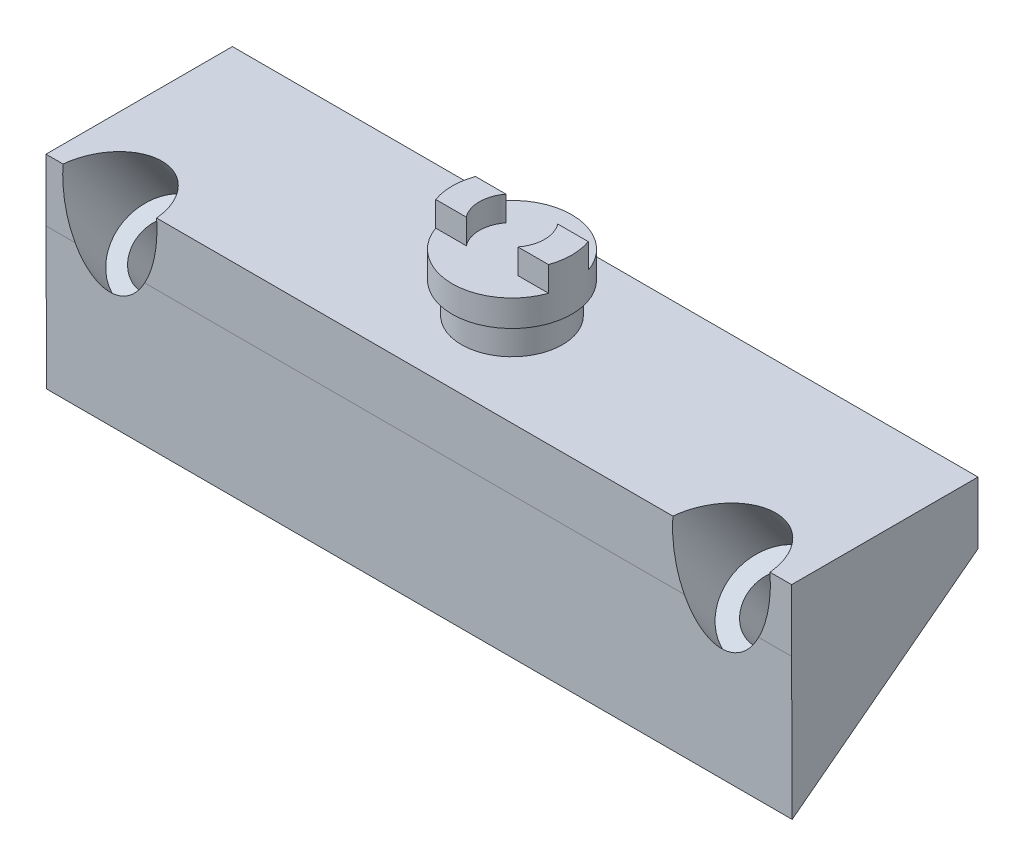
ISO-10303-21;
HEADER;
FILE_DESCRIPTION(('STEP AP214'),'2;1');
FILE_NAME('part.step','',(''),(''),'','','');
FILE_SCHEMA(('AUTOMOTIVE_DESIGN { 1 0 10303 214 1 1 1 1 }'));
ENDSEC;
DATA;
#1=APPLICATION_CONTEXT('core data for automotive mechanical design processes');
#2=APPLICATION_PROTOCOL_DEFINITION('international standard','automotive_design',2000,#1);
#3=PRODUCT_CONTEXT('',#1,'mechanical');
#4=PRODUCT('Part','Part','',(#3));
#5=PRODUCT_RELATED_PRODUCT_CATEGORY('part','',(#4));
#6=PRODUCT_DEFINITION_FORMATION('','',#4);
#7=PRODUCT_DEFINITION_CONTEXT('part definition',#1,'design');
#8=PRODUCT_DEFINITION('design','',#6,#7);
#9=PRODUCT_DEFINITION_SHAPE('','',#8);
#10=(LENGTH_UNIT() NAMED_UNIT(*) SI_UNIT(.MILLI.,.METRE.));
#11=(NAMED_UNIT(*) PLANE_ANGLE_UNIT() SI_UNIT($,.RADIAN.));
#12=(NAMED_UNIT(*) SI_UNIT($,.STERADIAN.) SOLID_ANGLE_UNIT());
#13=UNCERTAINTY_MEASURE_WITH_UNIT(LENGTH_MEASURE(1.E-05),#10,'distance_accuracy_value','');
#14=(GEOMETRIC_REPRESENTATION_CONTEXT(3) GLOBAL_UNCERTAINTY_ASSIGNED_CONTEXT((#13)) GLOBAL_UNIT_ASSIGNED_CONTEXT((#10,
#11,#12)) REPRESENTATION_CONTEXT('',''));
#15=CARTESIAN_POINT('',(0.,0.,0.));
#16=DIRECTION('',(0.,0.,1.));
#17=DIRECTION('',(1.,0.,0.));
#18=AXIS2_PLACEMENT_3D('',#15,#16,#17);
#19=CARTESIAN_POINT('',(0.,4.,0.));
#20=DIRECTION('',(0.,1.,0.));
#21=DIRECTION('',(0.,0.,1.));
#22=AXIS2_PLACEMENT_3D('',#19,#20,#21);
#23=PLANE('',#22);
#24=CARTESIAN_POINT('',(-18.7558197171155,4.,-5.96378441625708));
#25=DIRECTION('',(0.,1.,0.));
#26=DIRECTION('',(0.,0.,1.));
#27=AXIS2_PLACEMENT_3D('',#24,#25,#26);
#28=CIRCLE('',#27,3.25);
#29=CARTESIAN_POINT('',(-18.7558197171155,4.,-2.71378441625708));
#30=VERTEX_POINT('',#29);
#31=EDGE_CURVE('E177',#30,#30,#28,.T.);
#32=ORIENTED_EDGE('',*,*,#31,.F.);
#33=EDGE_LOOP('',(#32));
#34=FACE_BOUND('',#33,.T.);
#35=DIRECTION('',(1.,0.,0.));
#36=VECTOR('',#35,1.);
#37=CARTESIAN_POINT('',(-42.7558197171155,4.,0.0362155837429247));
#38=LINE('',#37,#36);
#39=CARTESIAN_POINT('',(-35.6307937768431,4.,0.0362155837429247));
#40=VERTEX_POINT('',#39);
#41=CARTESIAN_POINT('',(-2.39773889427231,4.,0.0362155837429247));
#42=VERTEX_POINT('',#41);
#43=EDGE_CURVE('E306',#40,#42,#38,.T.);
#44=ORIENTED_EDGE('',*,*,#43,.T.);
#45=CARTESIAN_POINT('',(0.730306236292222,4.,0.507436492852414));
#46=DIRECTION('',(0.,1.,0.));
#47=DIRECTION('',(0.,0.,1.));
#48=AXIS2_PLACEMENT_3D('',#45,#46,#47);
#49=ELLIPSE('',#48,3.95978550747745,3.15043191242157);
#50=CARTESIAN_POINT('',(3.85835136685676,4.,0.0362155837429247));
#51=VERTEX_POINT('',#50);
#52=EDGE_CURVE('E236',#42,#51,#49,.F.);
#53=ORIENTED_EDGE('',*,*,#52,.T.);
#54=CARTESIAN_POINT('',(5.24418028288455,4.,0.0362155837429247));
#55=VERTEX_POINT('',#54);
#56=EDGE_CURVE('E165',#51,#55,#38,.T.);
#57=ORIENTED_EDGE('',*,*,#56,.T.);
#58=DIRECTION('',(0.,0.,-1.));
#59=VECTOR('',#58,1.);
#60=CARTESIAN_POINT('',(5.24418028288455,4.,-11.9637844162571));
#61=LINE('',#60,#59);
#62=CARTESIAN_POINT('',(5.24418028288455,4.,-11.9637844162571));
#63=VERTEX_POINT('',#62);
#64=EDGE_CURVE('E305',#55,#63,#61,.T.);
#65=ORIENTED_EDGE('',*,*,#64,.T.);
#66=DIRECTION('',(-1.,0.,0.));
#67=VECTOR('',#66,1.);
#68=CARTESIAN_POINT('',(-42.7558197171155,4.,-11.9637844162571));
#69=LINE('',#68,#67);
#70=CARTESIAN_POINT('',(-42.7558197171155,4.,-11.9637844162571));
#71=VERTEX_POINT('',#70);
#72=EDGE_CURVE('E197',#63,#71,#69,.T.);
#73=ORIENTED_EDGE('',*,*,#72,.T.);
#74=DIRECTION('',(0.,0.,1.));
#75=VECTOR('',#74,1.);
#76=CARTESIAN_POINT('',(-42.7558197171155,4.,-11.9637844162571));
#77=LINE('',#76,#75);
#78=CARTESIAN_POINT('',(-42.7558197171155,4.,0.0362155837429247));
#79=VERTEX_POINT('',#78);
#80=EDGE_CURVE('E186',#71,#79,#77,.T.);
#81=ORIENTED_EDGE('',*,*,#80,.T.);
#82=CARTESIAN_POINT('',(-41.6566649898296,4.,0.0362155837429247));
#83=VERTEX_POINT('',#82);
#84=EDGE_CURVE('E302',#79,#83,#38,.T.);
#85=ORIENTED_EDGE('',*,*,#84,.T.);
#86=CARTESIAN_POINT('',(-38.6437293833364,4.,0.507436492852414));
#87=DIRECTION('',(0.,1.,0.));
#88=DIRECTION('',(0.,0.,1.));
#89=AXIS2_PLACEMENT_3D('',#86,#87,#88);
#90=ELLIPSE('',#89,3.8161710050473,3.03617125090642);
#91=EDGE_CURVE('E241',#83,#40,#90,.F.);
#92=ORIENTED_EDGE('',*,*,#91,.T.);
#93=EDGE_LOOP('',(#44,#53,#57,#65,#73,#81,#85,#92));
#94=FACE_BOUND('',#93,.T.);
#95=ADVANCED_FACE('F35',(#34,#94),#23,.T.);
#96=CARTESIAN_POINT('',(-42.7558197171155,4.,0.0362155837429247));
#97=DIRECTION('',(0.,0.,-1.));
#98=DIRECTION('',(-1.,0.,0.));
#99=AXIS2_PLACEMENT_3D('',#96,#97,#98);
#100=PLANE('',#99);
#101=CARTESIAN_POINT('',(0.730306236292222,3.38115190235146,0.0362155837429247));
#102=DIRECTION('',(0.,0.,-1.));
#103=DIRECTION('',(0.,1.,0.));
#104=AXIS2_PLACEMENT_3D('',#101,#102,#103);
#105=ELLIPSE('',#104,5.20033317925057,3.15043191242157);
#106=CARTESIAN_POINT('',(-1.66332995931738,0.,0.0362155837429247));
#107=VERTEX_POINT('',#106);
#108=EDGE_CURVE('E50',#42,#107,#105,.F.);
#109=ORIENTED_EDGE('',*,*,#108,.F.);
#110=ORIENTED_EDGE('',*,*,#43,.F.);
#111=CARTESIAN_POINT('',(-38.6437293833364,3.38115190235146,0.0362155837429247));
#112=DIRECTION('',(0.,0.,-1.));
#113=DIRECTION('',(0.,1.,0.));
#114=AXIS2_PLACEMENT_3D('',#111,#112,#113);
#115=ELLIPSE('',#114,5.01172618005863,3.03617125090642);
#116=CARTESIAN_POINT('',(-36.4026116115629,0.,0.0362155837429247));
#117=VERTEX_POINT('',#116);
#118=EDGE_CURVE('E226',#117,#40,#115,.F.);
#119=ORIENTED_EDGE('',*,*,#118,.F.);
#120=DIRECTION('',(1.,0.,0.));
#121=VECTOR('',#120,1.);
#122=CARTESIAN_POINT('',(-42.7558197171155,0.,0.0362155837429247));
#123=LINE('',#122,#121);
#124=EDGE_CURVE('E172',#117,#107,#123,.T.);
#125=ORIENTED_EDGE('',*,*,#124,.T.);
#126=EDGE_LOOP('',(#109,#110,#119,#125));
#127=FACE_BOUND('',#126,.T.);
#128=ADVANCED_FACE('F322',(#127),#100,.F.);
#129=CARTESIAN_POINT('',(3.12394243190178,0.,0.0362155837429247));
#130=VERTEX_POINT('',#129);
#131=EDGE_CURVE('E153',#130,#51,#105,.F.);
#132=ORIENTED_EDGE('',*,*,#131,.F.);
#133=CARTESIAN_POINT('',(5.24418028288455,0.,0.0362155837429247));
#134=VERTEX_POINT('',#133);
#135=EDGE_CURVE('E163',#130,#134,#123,.T.);
#136=ORIENTED_EDGE('',*,*,#135,.T.);
#137=DIRECTION('',(0.,-1.,0.));
#138=VECTOR('',#137,1.);
#139=CARTESIAN_POINT('',(5.24418028288455,4.,0.0362155837429247));
#140=LINE('',#139,#138);
#141=EDGE_CURVE('E199',#55,#134,#140,.T.);
#142=ORIENTED_EDGE('',*,*,#141,.F.);
#143=ORIENTED_EDGE('',*,*,#56,.F.);
#144=EDGE_LOOP('',(#132,#136,#142,#143));
#145=FACE_BOUND('',#144,.T.);
#146=ADVANCED_FACE('F161',(#145),#100,.F.);
#147=CARTESIAN_POINT('',(-42.7558197171155,-9.10980479772001,0.));
#148=DIRECTION('',(0.,-0.00397541971217707,0.999992097987835));
#149=DIRECTION('',(0.,-0.999992097987835,-0.00397541971217707));
#150=AXIS2_PLACEMENT_3D('',#147,#148,#149);
#151=PLANE('',#150);
#152=ORIENTED_EDGE('',*,*,#135,.F.);
#153=CARTESIAN_POINT('',(0.730306236292222,3.39889722740776,0.0497277335535979));
#154=DIRECTION('',(0.,-0.00397541971217707,0.999992097987835));
#155=DIRECTION('',(0.,0.999992097987835,0.00397541971217707));
#156=AXIS2_PLACEMENT_3D('',#153,#154,#155);
#157=ELLIPSE('',#156,5.22766743622865,3.15043191242157);
#158=EDGE_CURVE('E12',#130,#107,#157,.F.);
#159=ORIENTED_EDGE('',*,*,#158,.T.);
#160=ORIENTED_EDGE('',*,*,#124,.F.);
#161=CARTESIAN_POINT('',(-38.6437293833364,3.39889722740776,0.0497277335535979));
#162=DIRECTION('',(0.,-0.00397541971217707,0.999992097987835));
#163=DIRECTION('',(0.,0.999992097987835,0.00397541971217707));
#164=AXIS2_PLACEMENT_3D('',#161,#162,#163);
#165=ELLIPSE('',#164,5.03806907129031,3.03617125090642);
#166=CARTESIAN_POINT('',(-40.8848471551098,0.,0.0362155837429247));
#167=VERTEX_POINT('',#166);
#168=EDGE_CURVE('E43',#117,#167,#165,.F.);
#169=ORIENTED_EDGE('',*,*,#168,.T.);
#170=CARTESIAN_POINT('',(-42.7558197171155,0.,0.0362155837429247));
#171=VERTEX_POINT('',#170);
#172=EDGE_CURVE('E175',#171,#167,#123,.T.);
#173=ORIENTED_EDGE('',*,*,#172,.F.);
#174=DIRECTION('',(0.,-0.999992097987835,-0.00397541971217707));
#175=VECTOR('',#174,1.);
#176=CARTESIAN_POINT('',(-42.7558197171155,-9.10980479772001,0.));
#177=LINE('',#176,#175);
#178=CARTESIAN_POINT('',(-42.7558197171155,-9.10980479772001,0.));
#179=VERTEX_POINT('',#178);
#180=EDGE_CURVE('E250',#171,#179,#177,.T.);
#181=ORIENTED_EDGE('',*,*,#180,.T.);
#182=DIRECTION('',(1.,0.,0.));
#183=VECTOR('',#182,1.);
#184=CARTESIAN_POINT('',(-42.7558197171155,-9.10980479772001,0.));
#185=LINE('',#184,#183);
#186=CARTESIAN_POINT('',(5.24418028288455,-9.10980479772001,0.));
#187=VERTEX_POINT('',#186);
#188=EDGE_CURVE('E256',#179,#187,#185,.T.);
#189=ORIENTED_EDGE('',*,*,#188,.T.);
#190=DIRECTION('',(0.,-0.999992097987835,-0.00397541971217707));
#191=VECTOR('',#190,1.);
#192=CARTESIAN_POINT('',(5.24418028288455,-9.10980479772001,0.));
#193=LINE('',#192,#191);
#194=EDGE_CURVE('E170',#134,#187,#193,.T.);
#195=ORIENTED_EDGE('',*,*,#194,.F.);
#196=EDGE_LOOP('',(#152,#159,#160,#169,#173,#181,#189,#195));
#197=FACE_BOUND('',#196,.T.);
#198=ADVANCED_FACE('F168',(#197),#151,.T.);
#199=CARTESIAN_POINT('',(0.874180282884544,7.10198793872662,2.92283533348652));
#200=DIRECTION('',(0.,-0.795606708108926,-0.605813474604253));
#201=DIRECTION('',(0.,0.605813474604253,-0.795606708108926));
#202=AXIS2_PLACEMENT_3D('',#199,#200,#201);
#203=CYLINDRICAL_SURFACE('',#202,2.);
#204=CARTESIAN_POINT('',(0.874180282884544,-4.5686905484561,-5.96378441625708));
#205=DIRECTION('',(0.,-0.795606708108926,-0.605813474604253));
#206=DIRECTION('',(0.,0.605813474604253,-0.795606708108926));
#207=AXIS2_PLACEMENT_3D('',#204,#205,#206);
#208=CIRCLE('',#207,2.);
#209=CARTESIAN_POINT('',(0.874180282884544,-3.35706359924759,-7.55499783247493));
#210=VERTEX_POINT('',#209);
#211=EDGE_CURVE('E247',#210,#210,#208,.T.);
#212=ORIENTED_EDGE('',*,*,#211,.T.);
#213=EDGE_LOOP('',(#212));
#214=FACE_BOUND('',#213,.T.);
#215=CARTESIAN_POINT('',(0.874180282884544,-1.38626371603337,-3.54053051784994));
#216=DIRECTION('',(-2.86083379208435E-11,0.795606707817671,0.605813474986755));
#217=DIRECTION('',(0.,-0.605813474986755,0.795606707817671));
#218=AXIS2_PLACEMENT_3D('',#215,#216,#217);
#219=CIRCLE('',#218,2.);
#220=CARTESIAN_POINT('',(0.874180282884544,-2.59789066600688,-1.9493171022146));
#221=VERTEX_POINT('',#220);
#222=EDGE_CURVE('E166',#221,#221,#219,.F.);
#223=ORIENTED_EDGE('',*,*,#222,.F.);
#224=EDGE_LOOP('',(#223));
#225=FACE_BOUND('',#224,.T.);
#226=ADVANCED_FACE('F355',(#214,#225),#203,.F.);
#227=EDGE_CURVE('E57',#83,#167,#115,.F.);
#228=ORIENTED_EDGE('',*,*,#227,.F.);
#229=ORIENTED_EDGE('',*,*,#84,.F.);
#230=DIRECTION('',(0.,-1.,0.));
#231=VECTOR('',#230,1.);
#232=CARTESIAN_POINT('',(-42.7558197171155,4.,0.0362155837429247));
#233=LINE('',#232,#231);
#234=EDGE_CURVE('E201',#79,#171,#233,.T.);
#235=ORIENTED_EDGE('',*,*,#234,.T.);
#236=ORIENTED_EDGE('',*,*,#172,.T.);
#237=EDGE_LOOP('',(#228,#229,#235,#236));
#238=FACE_BOUND('',#237,.T.);
#239=ADVANCED_FACE('F318',(#238),#100,.F.);
#240=CARTESIAN_POINT('',(-38.5258197171154,7.10198793872662,2.92283533348652));
#241=DIRECTION('',(0.,-0.795606708108926,-0.605813474604253));
#242=DIRECTION('',(0.,0.605813474604253,-0.795606708108926));
#243=AXIS2_PLACEMENT_3D('',#240,#241,#242);
#244=CYLINDRICAL_SURFACE('',#243,2.);
#245=CARTESIAN_POINT('',(-38.5258197171154,-4.5686905484561,-5.96378441625708));
#246=DIRECTION('',(0.,-0.795606708108926,-0.605813474604253));
#247=DIRECTION('',(0.,0.605813474604253,-0.795606708108926));
#248=AXIS2_PLACEMENT_3D('',#245,#246,#247);
#249=CIRCLE('',#248,2.);
#250=CARTESIAN_POINT('',(-38.5258197171154,-3.35706359924759,-7.55499783247493));
#251=VERTEX_POINT('',#250);
#252=EDGE_CURVE('E244',#251,#251,#249,.T.);
#253=ORIENTED_EDGE('',*,*,#252,.T.);
#254=EDGE_LOOP('',(#253));
#255=FACE_BOUND('',#254,.T.);
#256=CARTESIAN_POINT('',(-38.5258197171154,-1.38626371603386,-3.54053051785032));
#257=DIRECTION('',(-2.96739577354543E-11,0.79560670781762,0.605813474986821));
#258=DIRECTION('',(0.,-0.605813474986821,0.79560670781762));
#259=AXIS2_PLACEMENT_3D('',#256,#257,#258);
#260=CIRCLE('',#259,2.);
#261=CARTESIAN_POINT('',(-38.5258197171154,-2.5978906660075,-1.94931710221507));
#262=VERTEX_POINT('',#261);
#263=EDGE_CURVE('E223',#262,#262,#260,.F.);
#264=ORIENTED_EDGE('',*,*,#263,.F.);
#265=EDGE_LOOP('',(#264));
#266=FACE_BOUND('',#265,.T.);
#267=ADVANCED_FACE('F341',(#255,#266),#244,.F.);
#268=CARTESIAN_POINT('',(-18.7558197171155,9.3,-5.96378441625708));
#269=DIRECTION('',(0.,1.,0.));
#270=DIRECTION('',(0.,0.,1.));
#271=AXIS2_PLACEMENT_3D('',#268,#269,#270);
#272=PLANE('',#271);
#273=CARTESIAN_POINT('',(-18.7558197171155,9.3,-5.96378441625708));
#274=DIRECTION('',(0.,1.,0.));
#275=DIRECTION('',(0.,0.,1.));
#276=AXIS2_PLACEMENT_3D('',#273,#274,#275);
#277=CIRCLE('',#276,2.1);
#278=CARTESIAN_POINT('',(-17.0910074153829,9.3,-4.68378441625708));
#279=VERTEX_POINT('',#278);
#280=CARTESIAN_POINT('',(-17.0910074153829,9.3,-7.24378441625708));
#281=VERTEX_POINT('',#280);
#282=EDGE_CURVE('E266',#279,#281,#277,.T.);
#283=ORIENTED_EDGE('',*,*,#282,.F.);
#284=DIRECTION('',(-1.,0.,0.));
#285=VECTOR('',#284,1.);
#286=CARTESIAN_POINT('',(-18.7558197171155,9.3,-4.68378441625708));
#287=LINE('',#286,#285);
#288=CARTESIAN_POINT('',(-15.124828117015,9.3,-4.68378441625708));
#289=VERTEX_POINT('',#288);
#290=EDGE_CURVE('E204',#289,#279,#287,.T.);
#291=ORIENTED_EDGE('',*,*,#290,.F.);
#292=CARTESIAN_POINT('',(-18.7558197171155,9.3,-5.96378441625708));
#293=DIRECTION('',(0.,1.,0.));
#294=DIRECTION('',(0.,0.,1.));
#295=AXIS2_PLACEMENT_3D('',#292,#293,#294);
#296=CIRCLE('',#295,3.85);
#297=CARTESIAN_POINT('',(-15.124828117015,9.3,-7.24378441625708));
#298=VERTEX_POINT('',#297);
#299=EDGE_CURVE('E294',#289,#298,#296,.T.);
#300=ORIENTED_EDGE('',*,*,#299,.T.);
#301=DIRECTION('',(1.,0.,0.));
#302=VECTOR('',#301,1.);
#303=CARTESIAN_POINT('',(-18.7558197171155,9.3,-7.24378441625708));
#304=LINE('',#303,#302);
#305=EDGE_CURVE('E210',#281,#298,#304,.T.);
#306=ORIENTED_EDGE('',*,*,#305,.F.);
#307=EDGE_LOOP('',(#283,#291,#300,#306));
#308=FACE_BOUND('',#307,.T.);
#309=ADVANCED_FACE('F343',(#308),#272,.T.);
#310=CARTESIAN_POINT('',(-24.156799196214,7.7,-4.68378441625708));
#311=DIRECTION('',(0.,0.,-1.));
#312=DIRECTION('',(-1.,0.,0.));
#313=AXIS2_PLACEMENT_3D('',#310,#311,#312);
#314=PLANE('',#313);
#315=DIRECTION('',(-1.,0.,0.));
#316=VECTOR('',#315,1.);
#317=CARTESIAN_POINT('',(-24.156799196214,7.7,-4.68378441625708));
#318=LINE('',#317,#316);
#319=CARTESIAN_POINT('',(-20.420632018848,7.7,-4.68378441625708));
#320=VERTEX_POINT('',#319);
#321=CARTESIAN_POINT('',(-22.3868113172159,7.7,-4.68378441625708));
#322=VERTEX_POINT('',#321);
#323=EDGE_CURVE('E283',#320,#322,#318,.T.);
#324=ORIENTED_EDGE('',*,*,#323,.F.);
#325=DIRECTION('',(0.,1.,0.));
#326=VECTOR('',#325,1.);
#327=CARTESIAN_POINT('',(-20.420632018848,7.7,-4.68378441625708));
#328=LINE('',#327,#326);
#329=CARTESIAN_POINT('',(-20.420632018848,9.3,-4.68378441625708));
#330=VERTEX_POINT('',#329);
#331=EDGE_CURVE('E270',#320,#330,#328,.T.);
#332=ORIENTED_EDGE('',*,*,#331,.T.);
#333=CARTESIAN_POINT('',(-22.3868113172159,9.3,-4.68378441625708));
#334=VERTEX_POINT('',#333);
#335=EDGE_CURVE('E203',#330,#334,#287,.T.);
#336=ORIENTED_EDGE('',*,*,#335,.T.);
#337=DIRECTION('',(0.,-1.,0.));
#338=VECTOR('',#337,1.);
#339=CARTESIAN_POINT('',(-22.3868113172159,9.3,-4.68378441625708));
#340=LINE('',#339,#338);
#341=EDGE_CURVE('E287',#322,#334,#340,.F.);
#342=ORIENTED_EDGE('',*,*,#341,.F.);
#343=EDGE_LOOP('',(#324,#332,#336,#342));
#344=FACE_BOUND('',#343,.T.);
#345=ADVANCED_FACE('F351',(#344),#314,.F.);
#346=CARTESIAN_POINT('',(-24.7025578300128,7.7,-7.24378441625708));
#347=DIRECTION('',(0.,0.,1.));
#348=DIRECTION('',(1.,0.,0.));
#349=AXIS2_PLACEMENT_3D('',#346,#347,#348);
#350=PLANE('',#349);
#351=DIRECTION('',(1.,0.,0.));
#352=VECTOR('',#351,1.);
#353=CARTESIAN_POINT('',(-24.7025578300128,7.7,-7.24378441625708));
#354=LINE('',#353,#352);
#355=CARTESIAN_POINT('',(-17.0910074153829,7.7,-7.24378441625708));
#356=VERTEX_POINT('',#355);
#357=CARTESIAN_POINT('',(-15.124828117015,7.7,-7.24378441625708));
#358=VERTEX_POINT('',#357);
#359=EDGE_CURVE('E273',#356,#358,#354,.T.);
#360=ORIENTED_EDGE('',*,*,#359,.F.);
#361=DIRECTION('',(0.,1.,0.));
#362=VECTOR('',#361,1.);
#363=CARTESIAN_POINT('',(-17.0910074153829,7.7,-7.24378441625708));
#364=LINE('',#363,#362);
#365=EDGE_CURVE('E220',#356,#281,#364,.T.);
#366=ORIENTED_EDGE('',*,*,#365,.T.);
#367=ORIENTED_EDGE('',*,*,#305,.T.);
#368=DIRECTION('',(0.,-1.,0.));
#369=VECTOR('',#368,1.);
#370=CARTESIAN_POINT('',(-15.124828117015,9.3,-7.24378441625708));
#371=LINE('',#370,#369);
#372=EDGE_CURVE('E277',#358,#298,#371,.F.);
#373=ORIENTED_EDGE('',*,*,#372,.F.);
#374=EDGE_LOOP('',(#360,#366,#367,#373));
#375=FACE_BOUND('',#374,.T.);
#376=ADVANCED_FACE('F375',(#375),#350,.F.);
#377=CARTESIAN_POINT('',(-42.7558197171155,4.,-11.9637844162571));
#378=DIRECTION('',(1.,0.,0.));
#379=DIRECTION('',(0.,0.,-1.));
#380=AXIS2_PLACEMENT_3D('',#377,#378,#379);
#381=PLANE('',#380);
#382=DIRECTION('',(0.,-1.,0.));
#383=VECTOR('',#382,1.);
#384=CARTESIAN_POINT('',(-42.7558197171155,4.,-11.9637844162571));
#385=LINE('',#384,#383);
#386=CARTESIAN_POINT('',(-42.7558197171155,0.,-11.9637844162571));
#387=VERTEX_POINT('',#386);
#388=EDGE_CURVE('E194',#71,#387,#385,.T.);
#389=ORIENTED_EDGE('',*,*,#388,.T.);
#390=DIRECTION('',(0.,0.605813474604253,-0.795606708108926));
#391=VECTOR('',#390,1.);
#392=CARTESIAN_POINT('',(-42.7558197171155,0.,-11.9637844162571));
#393=LINE('',#392,#391);
#394=EDGE_CURVE('E253',#179,#387,#393,.T.);
#395=ORIENTED_EDGE('',*,*,#394,.F.);
#396=ORIENTED_EDGE('',*,*,#180,.F.);
#397=ORIENTED_EDGE('',*,*,#234,.F.);
#398=ORIENTED_EDGE('',*,*,#80,.F.);
#399=EDGE_LOOP('',(#389,#395,#396,#397,#398));
#400=FACE_BOUND('',#399,.T.);
#401=ADVANCED_FACE('F37',(#400),#381,.F.);
#402=CARTESIAN_POINT('',(5.24418028288455,4.,-11.9637844162571));
#403=DIRECTION('',(-1.,0.,0.));
#404=DIRECTION('',(0.,0.,1.));
#405=AXIS2_PLACEMENT_3D('',#402,#403,#404);
#406=PLANE('',#405);
#407=ORIENTED_EDGE('',*,*,#141,.T.);
#408=ORIENTED_EDGE('',*,*,#194,.T.);
#409=DIRECTION('',(0.,0.605813474604253,-0.795606708108926));
#410=VECTOR('',#409,1.);
#411=CARTESIAN_POINT('',(5.24418028288455,0.,-11.9637844162571));
#412=LINE('',#411,#410);
#413=CARTESIAN_POINT('',(5.24418028288455,0.,-11.9637844162571));
#414=VERTEX_POINT('',#413);
#415=EDGE_CURVE('E254',#187,#414,#412,.T.);
#416=ORIENTED_EDGE('',*,*,#415,.T.);
#417=DIRECTION('',(0.,-1.,0.));
#418=VECTOR('',#417,1.);
#419=CARTESIAN_POINT('',(5.24418028288455,4.,-11.9637844162571));
#420=LINE('',#419,#418);
#421=EDGE_CURVE('E196',#63,#414,#420,.T.);
#422=ORIENTED_EDGE('',*,*,#421,.F.);
#423=ORIENTED_EDGE('',*,*,#64,.F.);
#424=EDGE_LOOP('',(#407,#408,#416,#422,#423));
#425=FACE_BOUND('',#424,.T.);
#426=ADVANCED_FACE('F324',(#425),#406,.F.);
#427=CARTESIAN_POINT('',(-42.7558197171155,4.,-11.9637844162571));
#428=DIRECTION('',(0.,0.,1.));
#429=DIRECTION('',(1.,0.,0.));
#430=AXIS2_PLACEMENT_3D('',#427,#428,#429);
#431=PLANE('',#430);
#432=DIRECTION('',(-1.,0.,0.));
#433=VECTOR('',#432,1.);
#434=CARTESIAN_POINT('',(-42.7558197171155,0.,-11.9637844162571));
#435=LINE('',#434,#433);
#436=EDGE_CURVE('E182',#414,#387,#435,.T.);
#437=ORIENTED_EDGE('',*,*,#436,.T.);
#438=ORIENTED_EDGE('',*,*,#388,.F.);
#439=ORIENTED_EDGE('',*,*,#72,.F.);
#440=ORIENTED_EDGE('',*,*,#421,.T.);
#441=EDGE_LOOP('',(#437,#438,#439,#440));
#442=FACE_BOUND('',#441,.T.);
#443=ADVANCED_FACE('F314',(#442),#431,.F.);
#444=CARTESIAN_POINT('',(-18.7558197171155,6.,-5.96378441625708));
#445=DIRECTION('',(0.,-1.,0.));
#446=DIRECTION('',(0.,0.,-1.));
#447=AXIS2_PLACEMENT_3D('',#444,#445,#446);
#448=CYLINDRICAL_SURFACE('',#447,3.25);
#449=CARTESIAN_POINT('',(-18.7558197171155,6.,-5.96378441625708));
#450=DIRECTION('',(0.,1.,0.));
#451=DIRECTION('',(0.,0.,1.));
#452=AXIS2_PLACEMENT_3D('',#449,#450,#451);
#453=CIRCLE('',#452,3.25);
#454=CARTESIAN_POINT('',(-18.7558197171155,6.,-2.71378441625708));
#455=VERTEX_POINT('',#454);
#456=EDGE_CURVE('E173',#455,#455,#453,.T.);
#457=ORIENTED_EDGE('',*,*,#456,.F.);
#458=EDGE_LOOP('',(#457));
#459=FACE_BOUND('',#458,.T.);
#460=ORIENTED_EDGE('',*,*,#31,.T.);
#461=EDGE_LOOP('',(#460));
#462=FACE_BOUND('',#461,.T.);
#463=ADVANCED_FACE('F367',(#459,#462),#448,.T.);
#464=CARTESIAN_POINT('',(-18.7558197171155,6.,-5.96378441625708));
#465=DIRECTION('',(0.,1.,0.));
#466=DIRECTION('',(0.,0.,1.));
#467=AXIS2_PLACEMENT_3D('',#464,#465,#466);
#468=PLANE('',#467);
#469=CARTESIAN_POINT('',(-18.7558197171155,6.,-5.96378441625708));
#470=DIRECTION('',(0.,1.,0.));
#471=DIRECTION('',(0.,0.,1.));
#472=AXIS2_PLACEMENT_3D('',#469,#470,#471);
#473=CIRCLE('',#472,3.85);
#474=CARTESIAN_POINT('',(-18.7558197171155,6.,-2.11378441625708));
#475=VERTEX_POINT('',#474);
#476=EDGE_CURVE('E293',#475,#475,#473,.T.);
#477=ORIENTED_EDGE('',*,*,#476,.F.);
#478=EDGE_LOOP('',(#477));
#479=FACE_BOUND('',#478,.T.);
#480=ORIENTED_EDGE('',*,*,#456,.T.);
#481=EDGE_LOOP('',(#480));
#482=FACE_BOUND('',#481,.T.);
#483=ADVANCED_FACE('F438',(#479,#482),#468,.F.);
#484=CARTESIAN_POINT('',(-18.7558197171155,9.3,-5.96378441625708));
#485=DIRECTION('',(0.,-1.,0.));
#486=DIRECTION('',(0.,0.,-1.));
#487=AXIS2_PLACEMENT_3D('',#484,#485,#486);
#488=CYLINDRICAL_SURFACE('',#487,3.85);
#489=CARTESIAN_POINT('',(-22.3868113172159,9.3,-7.24378441625708));
#490=VERTEX_POINT('',#489);
#491=EDGE_CURVE('E297',#490,#334,#296,.T.);
#492=ORIENTED_EDGE('',*,*,#491,.F.);
#493=DIRECTION('',(0.,-1.,0.));
#494=VECTOR('',#493,1.);
#495=CARTESIAN_POINT('',(-22.3868113172159,9.3,-7.24378441625708));
#496=LINE('',#495,#494);
#497=CARTESIAN_POINT('',(-22.3868113172159,7.7,-7.24378441625708));
#498=VERTEX_POINT('',#497);
#499=EDGE_CURVE('E280',#490,#498,#496,.T.);
#500=ORIENTED_EDGE('',*,*,#499,.T.);
#501=CARTESIAN_POINT('',(-18.7558197171155,7.7,-5.96378441625708));
#502=DIRECTION('',(0.,-1.,0.));
#503=DIRECTION('',(0.,0.,-1.));
#504=AXIS2_PLACEMENT_3D('',#501,#502,#503);
#505=CIRCLE('',#504,3.85);
#506=EDGE_CURVE('E214',#498,#358,#505,.T.);
#507=ORIENTED_EDGE('',*,*,#506,.T.);
#508=ORIENTED_EDGE('',*,*,#372,.T.);
#509=ORIENTED_EDGE('',*,*,#299,.F.);
#510=DIRECTION('',(0.,-1.,0.));
#511=VECTOR('',#510,1.);
#512=CARTESIAN_POINT('',(-15.124828117015,9.3,-4.68378441625708));
#513=LINE('',#512,#511);
#514=CARTESIAN_POINT('',(-15.124828117015,7.7,-4.68378441625708));
#515=VERTEX_POINT('',#514);
#516=EDGE_CURVE('E290',#289,#515,#513,.T.);
#517=ORIENTED_EDGE('',*,*,#516,.T.);
#518=CARTESIAN_POINT('',(-18.7558197171155,7.7,-5.96378441625708));
#519=DIRECTION('',(0.,-1.,0.));
#520=DIRECTION('',(0.,0.,-1.));
#521=AXIS2_PLACEMENT_3D('',#518,#519,#520);
#522=CIRCLE('',#521,3.85);
#523=EDGE_CURVE('E207',#515,#322,#522,.T.);
#524=ORIENTED_EDGE('',*,*,#523,.T.);
#525=ORIENTED_EDGE('',*,*,#341,.T.);
#526=EDGE_LOOP('',(#492,#500,#507,#508,#509,#517,#524,#525));
#527=FACE_BOUND('',#526,.T.);
#528=ORIENTED_EDGE('',*,*,#476,.T.);
#529=EDGE_LOOP('',(#528));
#530=FACE_BOUND('',#529,.T.);
#531=ADVANCED_FACE('F410',(#527,#530),#488,.T.);
#532=CARTESIAN_POINT('',(-20.420632018848,9.3,-7.24378441625708));
#533=VERTEX_POINT('',#532);
#534=EDGE_CURVE('E261',#533,#330,#277,.T.);
#535=ORIENTED_EDGE('',*,*,#534,.F.);
#536=EDGE_CURVE('E211',#490,#533,#304,.T.);
#537=ORIENTED_EDGE('',*,*,#536,.F.);
#538=ORIENTED_EDGE('',*,*,#491,.T.);
#539=ORIENTED_EDGE('',*,*,#335,.F.);
#540=EDGE_LOOP('',(#535,#537,#538,#539));
#541=FACE_BOUND('',#540,.T.);
#542=ADVANCED_FACE('F354',(#541),#272,.T.);
#543=CARTESIAN_POINT('',(0.,7.7,0.));
#544=DIRECTION('',(0.,-1.,0.));
#545=DIRECTION('',(0.,0.,-1.));
#546=AXIS2_PLACEMENT_3D('',#543,#544,#545);
#547=PLANE('',#546);
#548=CARTESIAN_POINT('',(-17.0910074153829,7.7,-4.68378441625708));
#549=VERTEX_POINT('',#548);
#550=EDGE_CURVE('E284',#515,#549,#318,.T.);
#551=ORIENTED_EDGE('',*,*,#550,.T.);
#552=CARTESIAN_POINT('',(-18.7558197171155,7.7,-5.96378441625708));
#553=DIRECTION('',(0.,1.,0.));
#554=DIRECTION('',(0.,0.,1.));
#555=AXIS2_PLACEMENT_3D('',#552,#553,#554);
#556=CIRCLE('',#555,2.1);
#557=EDGE_CURVE('E262',#549,#356,#556,.T.);
#558=ORIENTED_EDGE('',*,*,#557,.T.);
#559=ORIENTED_EDGE('',*,*,#359,.T.);
#560=ORIENTED_EDGE('',*,*,#506,.F.);
#561=CARTESIAN_POINT('',(-20.420632018848,7.7,-7.24378441625708));
#562=VERTEX_POINT('',#561);
#563=EDGE_CURVE('E274',#498,#562,#354,.T.);
#564=ORIENTED_EDGE('',*,*,#563,.T.);
#565=EDGE_CURVE('E265',#562,#320,#556,.T.);
#566=ORIENTED_EDGE('',*,*,#565,.T.);
#567=ORIENTED_EDGE('',*,*,#323,.T.);
#568=ORIENTED_EDGE('',*,*,#523,.F.);
#569=EDGE_LOOP('',(#551,#558,#559,#560,#564,#566,#567,#568));
#570=FACE_BOUND('',#569,.T.);
#571=ADVANCED_FACE('F400',(#570),#547,.F.);
#572=ORIENTED_EDGE('',*,*,#290,.T.);
#573=DIRECTION('',(0.,1.,0.));
#574=VECTOR('',#573,1.);
#575=CARTESIAN_POINT('',(-17.0910074153829,7.7,-4.68378441625708));
#576=LINE('',#575,#574);
#577=EDGE_CURVE('E264',#279,#549,#576,.F.);
#578=ORIENTED_EDGE('',*,*,#577,.T.);
#579=ORIENTED_EDGE('',*,*,#550,.F.);
#580=ORIENTED_EDGE('',*,*,#516,.F.);
#581=EDGE_LOOP('',(#572,#578,#579,#580));
#582=FACE_BOUND('',#581,.T.);
#583=ADVANCED_FACE('F387',(#582),#314,.F.);
#584=ORIENTED_EDGE('',*,*,#536,.T.);
#585=DIRECTION('',(0.,1.,0.));
#586=VECTOR('',#585,1.);
#587=CARTESIAN_POINT('',(-20.420632018848,7.7,-7.24378441625708));
#588=LINE('',#587,#586);
#589=EDGE_CURVE('E217',#533,#562,#588,.F.);
#590=ORIENTED_EDGE('',*,*,#589,.T.);
#591=ORIENTED_EDGE('',*,*,#563,.F.);
#592=ORIENTED_EDGE('',*,*,#499,.F.);
#593=EDGE_LOOP('',(#584,#590,#591,#592));
#594=FACE_BOUND('',#593,.T.);
#595=ADVANCED_FACE('F381',(#594),#350,.F.);
#596=CARTESIAN_POINT('',(-18.7558197171155,7.7,-5.96378441625708));
#597=DIRECTION('',(0.,1.,0.));
#598=DIRECTION('',(0.,0.,1.));
#599=AXIS2_PLACEMENT_3D('',#596,#597,#598);
#600=CYLINDRICAL_SURFACE('',#599,2.1);
#601=ORIENTED_EDGE('',*,*,#565,.F.);
#602=ORIENTED_EDGE('',*,*,#589,.F.);
#603=ORIENTED_EDGE('',*,*,#534,.T.);
#604=ORIENTED_EDGE('',*,*,#331,.F.);
#605=EDGE_LOOP('',(#601,#602,#603,#604));
#606=FACE_BOUND('',#605,.T.);
#607=ADVANCED_FACE('F391',(#606),#600,.F.);
#608=ORIENTED_EDGE('',*,*,#282,.T.);
#609=ORIENTED_EDGE('',*,*,#365,.F.);
#610=ORIENTED_EDGE('',*,*,#557,.F.);
#611=ORIENTED_EDGE('',*,*,#577,.F.);
#612=EDGE_LOOP('',(#608,#609,#610,#611));
#613=FACE_BOUND('',#612,.T.);
#614=ADVANCED_FACE('F397',(#613),#600,.F.);
#615=CARTESIAN_POINT('',(-42.7558197171155,0.,-11.9637844162571));
#616=DIRECTION('',(0.,-0.795606708108926,-0.605813474604253));
#617=DIRECTION('',(0.,0.605813474604253,-0.795606708108926));
#618=AXIS2_PLACEMENT_3D('',#615,#616,#617);
#619=PLANE('',#618);
#620=ORIENTED_EDGE('',*,*,#252,.F.);
#621=EDGE_LOOP('',(#620));
#622=FACE_BOUND('',#621,.T.);
#623=ORIENTED_EDGE('',*,*,#211,.F.);
#624=EDGE_LOOP('',(#623));
#625=FACE_BOUND('',#624,.T.);
#626=ORIENTED_EDGE('',*,*,#415,.F.);
#627=ORIENTED_EDGE('',*,*,#188,.F.);
#628=ORIENTED_EDGE('',*,*,#394,.T.);
#629=ORIENTED_EDGE('',*,*,#436,.F.);
#630=EDGE_LOOP('',(#626,#627,#628,#629));
#631=FACE_BOUND('',#630,.T.);
#632=ADVANCED_FACE('F327',(#622,#625,#631),#619,.T.);
#633=CARTESIAN_POINT('',(9.6375727016982E-11,-2.58398881501058,-1.96757421470545));
#634=DIRECTION('',(-2.96739577354543E-11,0.79560670781762,0.605813474986821));
#635=DIRECTION('',(0.,-0.605813474986821,0.79560670781762));
#636=AXIS2_PLACEMENT_3D('',#633,#634,#635);
#637=PLANE('',#636);
#638=CARTESIAN_POINT('',(-38.6437293833364,-1.36052789389566,-3.57432902774365));
#639=DIRECTION('',(0.,-0.795606708108926,-0.605813474604253));
#640=DIRECTION('',(0.,0.605813474604253,-0.795606708108926));
#641=AXIS2_PLACEMENT_3D('',#638,#639,#640);
#642=CIRCLE('',#641,3.03617125090642);
#643=CARTESIAN_POINT('',(-38.6437293833364,0.478825561109498,-5.98992724193226));
#644=VERTEX_POINT('',#643);
#645=EDGE_CURVE('E227',#644,#644,#642,.T.);
#646=ORIENTED_EDGE('',*,*,#645,.F.);
#647=EDGE_LOOP('',(#646));
#648=FACE_BOUND('',#647,.T.);
#649=ORIENTED_EDGE('',*,*,#263,.T.);
#650=EDGE_LOOP('',(#649));
#651=FACE_BOUND('',#650,.T.);
#652=ADVANCED_FACE('F332',(#648,#651),#637,.T.);
#653=CARTESIAN_POINT('',(-38.6437293833364,-1.36052789389566,-3.57432902774365));
#654=DIRECTION('',(0.,0.795606708108926,0.605813474604253));
#655=DIRECTION('',(0.,-0.605813474604253,0.795606708108926));
#656=AXIS2_PLACEMENT_3D('',#653,#654,#655);
#657=CYLINDRICAL_SURFACE('',#656,3.03617125090642);
#658=ORIENTED_EDGE('',*,*,#227,.T.);
#659=ORIENTED_EDGE('',*,*,#168,.F.);
#660=ORIENTED_EDGE('',*,*,#118,.T.);
#661=ORIENTED_EDGE('',*,*,#91,.F.);
#662=EDGE_LOOP('',(#658,#659,#660,#661));
#663=FACE_BOUND('',#662,.T.);
#664=ORIENTED_EDGE('',*,*,#645,.T.);
#665=EDGE_LOOP('',(#664));
#666=FACE_BOUND('',#665,.T.);
#667=ADVANCED_FACE('F328',(#663,#666),#657,.F.);
#668=CARTESIAN_POINT('',(9.29147837790988E-11,-2.58398881593957,-1.96757421541248));
#669=DIRECTION('',(-2.86083379208435E-11,0.795606707817671,0.605813474986755));
#670=DIRECTION('',(0.,-0.605813474986755,0.795606707817671));
#671=AXIS2_PLACEMENT_3D('',#668,#669,#670);
#672=PLANE('',#671);
#673=CARTESIAN_POINT('',(0.730306236292222,-1.36052789389566,-3.57432902774365));
#674=DIRECTION('',(0.,-0.795606708108926,-0.605813474604253));
#675=DIRECTION('',(0.,0.605813474604253,-0.795606708108926));
#676=AXIS2_PLACEMENT_3D('',#673,#674,#675);
#677=CIRCLE('',#676,3.15043191242157);
#678=CARTESIAN_POINT('',(0.730306236292222,0.548046209472575,-6.08083379070668));
#679=VERTEX_POINT('',#678);
#680=EDGE_CURVE('E229',#679,#679,#677,.T.);
#681=ORIENTED_EDGE('',*,*,#680,.F.);
#682=EDGE_LOOP('',(#681));
#683=FACE_BOUND('',#682,.T.);
#684=ORIENTED_EDGE('',*,*,#222,.T.);
#685=EDGE_LOOP('',(#684));
#686=FACE_BOUND('',#685,.T.);
#687=ADVANCED_FACE('F331',(#683,#686),#672,.T.);
#688=CARTESIAN_POINT('',(0.730306236292222,-1.36052789389566,-3.57432902774365));
#689=DIRECTION('',(0.,0.795606708108926,0.605813474604253));
#690=DIRECTION('',(0.,-0.605813474604253,0.795606708108926));
#691=AXIS2_PLACEMENT_3D('',#688,#689,#690);
#692=CYLINDRICAL_SURFACE('',#691,3.15043191242157);
#693=ORIENTED_EDGE('',*,*,#108,.T.);
#694=ORIENTED_EDGE('',*,*,#158,.F.);
#695=ORIENTED_EDGE('',*,*,#131,.T.);
#696=ORIENTED_EDGE('',*,*,#52,.F.);
#697=EDGE_LOOP('',(#693,#694,#695,#696));
#698=FACE_BOUND('',#697,.T.);
#699=ORIENTED_EDGE('',*,*,#680,.T.);
#700=EDGE_LOOP('',(#699));
#701=FACE_BOUND('',#700,.T.);
#702=ADVANCED_FACE('F151',(#698,#701),#692,.F.);
#703=CLOSED_SHELL('',(#95,#128,#146,#198,#226,#239,#267,#309,#345,#376,#401,#426,#443,#463,#483,
#531,#542,#571,#583,#595,#607,#614,#632,#652,#667,#687,#702));
#704=MANIFOLD_SOLID_BREP('B2',#703);
#705=ADVANCED_BREP_SHAPE_REPRESENTATION('',(#18,#704),#14);
#706=SHAPE_DEFINITION_REPRESENTATION(#9,#705);
ENDSEC;
END-ISO-10303-21;
